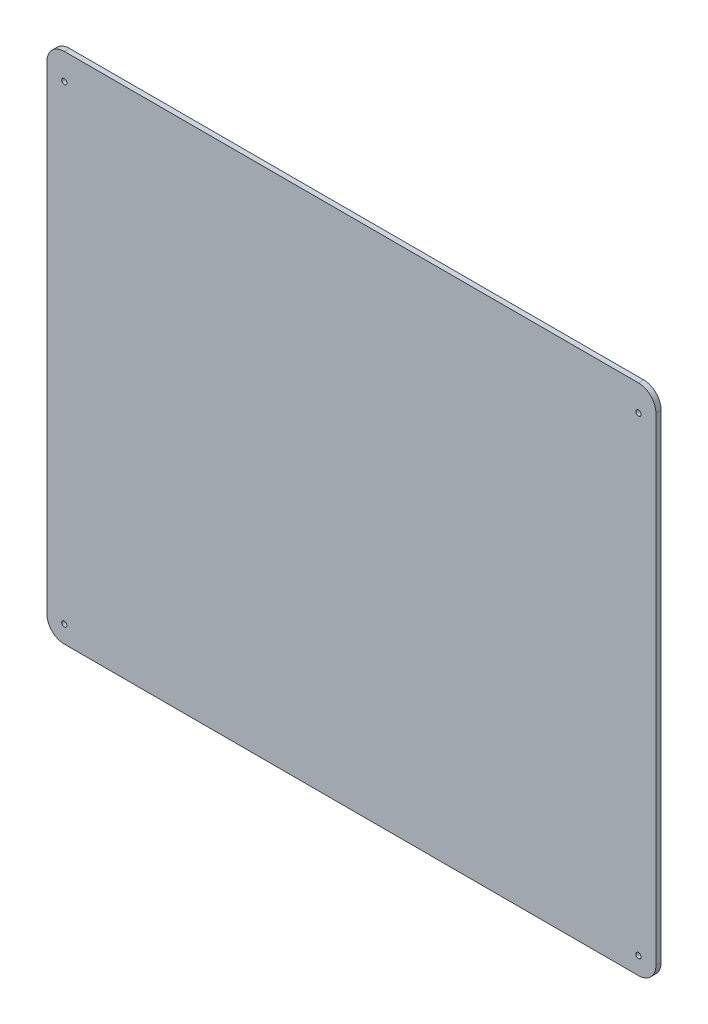
ISO-10303-21;
HEADER;
FILE_DESCRIPTION(('STEP AP214'),'2;1');
FILE_NAME('part.step','',(''),(''),'','','');
FILE_SCHEMA(('AUTOMOTIVE_DESIGN { 1 0 10303 214 1 1 1 1 }'));
ENDSEC;
DATA;
#1=APPLICATION_CONTEXT('core data for automotive mechanical design processes');
#2=APPLICATION_PROTOCOL_DEFINITION('international standard','automotive_design',2000,#1);
#3=PRODUCT_CONTEXT('',#1,'mechanical');
#4=PRODUCT('Part','Part','',(#3));
#5=PRODUCT_RELATED_PRODUCT_CATEGORY('part','',(#4));
#6=PRODUCT_DEFINITION_FORMATION('','',#4);
#7=PRODUCT_DEFINITION_CONTEXT('part definition',#1,'design');
#8=PRODUCT_DEFINITION('design','',#6,#7);
#9=PRODUCT_DEFINITION_SHAPE('','',#8);
#10=(LENGTH_UNIT() NAMED_UNIT(*) SI_UNIT(.MILLI.,.METRE.));
#11=(NAMED_UNIT(*) PLANE_ANGLE_UNIT() SI_UNIT($,.RADIAN.));
#12=(NAMED_UNIT(*) SI_UNIT($,.STERADIAN.) SOLID_ANGLE_UNIT());
#13=UNCERTAINTY_MEASURE_WITH_UNIT(LENGTH_MEASURE(1.E-05),#10,'distance_accuracy_value','');
#14=(GEOMETRIC_REPRESENTATION_CONTEXT(3) GLOBAL_UNCERTAINTY_ASSIGNED_CONTEXT((#13)) GLOBAL_UNIT_ASSIGNED_CONTEXT((#10,
#11,#12)) REPRESENTATION_CONTEXT('',''));
#15=CARTESIAN_POINT('',(0.,0.,0.));
#16=DIRECTION('',(0.,0.,1.));
#17=DIRECTION('',(1.,0.,0.));
#18=AXIS2_PLACEMENT_3D('',#15,#16,#17);
#19=CARTESIAN_POINT('',(10.,285.,3.));
#20=DIRECTION('',(0.,0.,-1.));
#21=DIRECTION('',(-1.,0.,0.));
#22=AXIS2_PLACEMENT_3D('',#19,#20,#21);
#23=CYLINDRICAL_SURFACE('',#22,10.);
#24=CARTESIAN_POINT('',(10.,285.,0.));
#25=DIRECTION('',(0.,0.,1.));
#26=DIRECTION('',(1.,0.,0.));
#27=AXIS2_PLACEMENT_3D('',#24,#25,#26);
#28=CIRCLE('',#27,10.);
#29=CARTESIAN_POINT('',(0.,285.,0.));
#30=VERTEX_POINT('',#29);
#31=CARTESIAN_POINT('',(10.0000000000001,295.,0.));
#32=VERTEX_POINT('',#31);
#33=EDGE_CURVE('E139',#30,#32,#28,.F.);
#34=ORIENTED_EDGE('',*,*,#33,.F.);
#35=DIRECTION('',(0.,0.,-1.));
#36=VECTOR('',#35,1.);
#37=CARTESIAN_POINT('',(0.,285.,3.));
#38=LINE('',#37,#36);
#39=CARTESIAN_POINT('',(0.,285.,3.));
#40=VERTEX_POINT('',#39);
#41=EDGE_CURVE('E11',#40,#30,#38,.T.);
#42=ORIENTED_EDGE('',*,*,#41,.F.);
#43=CARTESIAN_POINT('',(10.,285.,3.));
#44=DIRECTION('',(0.,0.,1.));
#45=DIRECTION('',(1.,0.,0.));
#46=AXIS2_PLACEMENT_3D('',#43,#44,#45);
#47=CIRCLE('',#46,10.);
#48=CARTESIAN_POINT('',(10.0000000000001,295.,3.));
#49=VERTEX_POINT('',#48);
#50=EDGE_CURVE('E189',#40,#49,#47,.F.);
#51=ORIENTED_EDGE('',*,*,#50,.T.);
#52=DIRECTION('',(0.,0.,-1.));
#53=VECTOR('',#52,1.);
#54=CARTESIAN_POINT('',(10.0000000000001,295.,3.));
#55=LINE('',#54,#53);
#56=EDGE_CURVE('E51',#49,#32,#55,.T.);
#57=ORIENTED_EDGE('',*,*,#56,.T.);
#58=EDGE_LOOP('',(#34,#42,#51,#57));
#59=FACE_BOUND('',#58,.T.);
#60=ADVANCED_FACE('F34',(#59),#23,.T.);
#61=CARTESIAN_POINT('',(0.,0.,3.));
#62=DIRECTION('',(-1.,0.,0.));
#63=DIRECTION('',(0.,0.,1.));
#64=AXIS2_PLACEMENT_3D('',#61,#62,#63);
#65=PLANE('',#64);
#66=DIRECTION('',(0.,1.,0.));
#67=VECTOR('',#66,1.);
#68=CARTESIAN_POINT('',(0.,0.,0.));
#69=LINE('',#68,#67);
#70=CARTESIAN_POINT('',(0.,10.0000000000001,0.));
#71=VERTEX_POINT('',#70);
#72=EDGE_CURVE('E141',#71,#30,#69,.T.);
#73=ORIENTED_EDGE('',*,*,#72,.F.);
#74=DIRECTION('',(0.,0.,-1.));
#75=VECTOR('',#74,1.);
#76=CARTESIAN_POINT('',(0.,10.0000000000001,3.));
#77=LINE('',#76,#75);
#78=CARTESIAN_POINT('',(0.,10.0000000000001,3.));
#79=VERTEX_POINT('',#78);
#80=EDGE_CURVE('E43',#79,#71,#77,.T.);
#81=ORIENTED_EDGE('',*,*,#80,.F.);
#82=DIRECTION('',(0.,1.,0.));
#83=VECTOR('',#82,1.);
#84=CARTESIAN_POINT('',(0.,0.,3.));
#85=LINE('',#84,#83);
#86=EDGE_CURVE('E187',#79,#40,#85,.T.);
#87=ORIENTED_EDGE('',*,*,#86,.T.);
#88=ORIENTED_EDGE('',*,*,#41,.T.);
#89=EDGE_LOOP('',(#73,#81,#87,#88));
#90=FACE_BOUND('',#89,.T.);
#91=ADVANCED_FACE('F177',(#90),#65,.T.);
#92=CARTESIAN_POINT('',(10.,10.,3.));
#93=DIRECTION('',(0.,0.,-1.));
#94=DIRECTION('',(-1.,0.,0.));
#95=AXIS2_PLACEMENT_3D('',#92,#93,#94);
#96=CYLINDRICAL_SURFACE('',#95,10.);
#97=CARTESIAN_POINT('',(10.,10.,0.));
#98=DIRECTION('',(0.,0.,1.));
#99=DIRECTION('',(1.,0.,0.));
#100=AXIS2_PLACEMENT_3D('',#97,#98,#99);
#101=CIRCLE('',#100,10.);
#102=CARTESIAN_POINT('',(10.0000000000001,0.,0.));
#103=VERTEX_POINT('',#102);
#104=EDGE_CURVE('E144',#103,#71,#101,.F.);
#105=ORIENTED_EDGE('',*,*,#104,.F.);
#106=DIRECTION('',(0.,0.,-1.));
#107=VECTOR('',#106,1.);
#108=CARTESIAN_POINT('',(10.0000000000001,0.,3.));
#109=LINE('',#108,#107);
#110=CARTESIAN_POINT('',(10.0000000000001,0.,3.));
#111=VERTEX_POINT('',#110);
#112=EDGE_CURVE('E166',#111,#103,#109,.T.);
#113=ORIENTED_EDGE('',*,*,#112,.F.);
#114=CARTESIAN_POINT('',(10.,10.,3.));
#115=DIRECTION('',(0.,0.,1.));
#116=DIRECTION('',(1.,0.,0.));
#117=AXIS2_PLACEMENT_3D('',#114,#115,#116);
#118=CIRCLE('',#117,10.);
#119=EDGE_CURVE('E173',#111,#79,#118,.F.);
#120=ORIENTED_EDGE('',*,*,#119,.T.);
#121=ORIENTED_EDGE('',*,*,#80,.T.);
#122=EDGE_LOOP('',(#105,#113,#120,#121));
#123=FACE_BOUND('',#122,.T.);
#124=ADVANCED_FACE('F171',(#123),#96,.T.);
#125=CARTESIAN_POINT('',(0.,0.,3.));
#126=DIRECTION('',(0.,1.,0.));
#127=DIRECTION('',(0.,0.,1.));
#128=AXIS2_PLACEMENT_3D('',#125,#126,#127);
#129=PLANE('',#128);
#130=DIRECTION('',(1.,0.,0.));
#131=VECTOR('',#130,1.);
#132=CARTESIAN_POINT('',(0.,0.,0.));
#133=LINE('',#132,#131);
#134=CARTESIAN_POINT('',(340.,0.,0.));
#135=VERTEX_POINT('',#134);
#136=EDGE_CURVE('E147',#103,#135,#133,.T.);
#137=ORIENTED_EDGE('',*,*,#136,.T.);
#138=DIRECTION('',(0.,0.,-1.));
#139=VECTOR('',#138,1.);
#140=CARTESIAN_POINT('',(340.,0.,3.));
#141=LINE('',#140,#139);
#142=CARTESIAN_POINT('',(340.,0.,3.));
#143=VERTEX_POINT('',#142);
#144=EDGE_CURVE('E163',#143,#135,#141,.T.);
#145=ORIENTED_EDGE('',*,*,#144,.F.);
#146=DIRECTION('',(1.,0.,0.));
#147=VECTOR('',#146,1.);
#148=CARTESIAN_POINT('',(0.,0.,3.));
#149=LINE('',#148,#147);
#150=EDGE_CURVE('E185',#111,#143,#149,.T.);
#151=ORIENTED_EDGE('',*,*,#150,.F.);
#152=ORIENTED_EDGE('',*,*,#112,.T.);
#153=EDGE_LOOP('',(#137,#145,#151,#152));
#154=FACE_BOUND('',#153,.T.);
#155=ADVANCED_FACE('F183',(#154),#129,.F.);
#156=CARTESIAN_POINT('',(340.,10.,3.));
#157=DIRECTION('',(0.,0.,-1.));
#158=DIRECTION('',(-1.,0.,0.));
#159=AXIS2_PLACEMENT_3D('',#156,#157,#158);
#160=CYLINDRICAL_SURFACE('',#159,10.);
#161=CARTESIAN_POINT('',(340.,10.,0.));
#162=DIRECTION('',(0.,0.,1.));
#163=DIRECTION('',(1.,0.,0.));
#164=AXIS2_PLACEMENT_3D('',#161,#162,#163);
#165=CIRCLE('',#164,10.);
#166=CARTESIAN_POINT('',(350.,10.0000000000001,0.));
#167=VERTEX_POINT('',#166);
#168=EDGE_CURVE('E150',#135,#167,#165,.T.);
#169=ORIENTED_EDGE('',*,*,#168,.T.);
#170=DIRECTION('',(0.,0.,-1.));
#171=VECTOR('',#170,1.);
#172=CARTESIAN_POINT('',(350.,10.0000000000001,3.));
#173=LINE('',#172,#171);
#174=CARTESIAN_POINT('',(350.,10.0000000000001,3.));
#175=VERTEX_POINT('',#174);
#176=EDGE_CURVE('E119',#175,#167,#173,.T.);
#177=ORIENTED_EDGE('',*,*,#176,.F.);
#178=CARTESIAN_POINT('',(340.,10.,3.));
#179=DIRECTION('',(0.,0.,1.));
#180=DIRECTION('',(1.,0.,0.));
#181=AXIS2_PLACEMENT_3D('',#178,#179,#180);
#182=CIRCLE('',#181,10.);
#183=EDGE_CURVE('E108',#143,#175,#182,.T.);
#184=ORIENTED_EDGE('',*,*,#183,.F.);
#185=ORIENTED_EDGE('',*,*,#144,.T.);
#186=EDGE_LOOP('',(#169,#177,#184,#185));
#187=FACE_BOUND('',#186,.T.);
#188=ADVANCED_FACE('F262',(#187),#160,.T.);
#189=CARTESIAN_POINT('',(350.,0.,3.));
#190=DIRECTION('',(-1.,0.,0.));
#191=DIRECTION('',(0.,0.,1.));
#192=AXIS2_PLACEMENT_3D('',#189,#190,#191);
#193=PLANE('',#192);
#194=DIRECTION('',(0.,1.,0.));
#195=VECTOR('',#194,1.);
#196=CARTESIAN_POINT('',(350.,0.,0.));
#197=LINE('',#196,#195);
#198=CARTESIAN_POINT('',(350.,285.,0.));
#199=VERTEX_POINT('',#198);
#200=EDGE_CURVE('E116',#167,#199,#197,.T.);
#201=ORIENTED_EDGE('',*,*,#200,.T.);
#202=DIRECTION('',(0.,0.,-1.));
#203=VECTOR('',#202,1.);
#204=CARTESIAN_POINT('',(350.,285.,3.));
#205=LINE('',#204,#203);
#206=CARTESIAN_POINT('',(350.,285.,3.));
#207=VERTEX_POINT('',#206);
#208=EDGE_CURVE('E114',#207,#199,#205,.T.);
#209=ORIENTED_EDGE('',*,*,#208,.F.);
#210=DIRECTION('',(0.,1.,0.));
#211=VECTOR('',#210,1.);
#212=CARTESIAN_POINT('',(350.,0.,3.));
#213=LINE('',#212,#211);
#214=EDGE_CURVE('E101',#175,#207,#213,.T.);
#215=ORIENTED_EDGE('',*,*,#214,.F.);
#216=ORIENTED_EDGE('',*,*,#176,.T.);
#217=EDGE_LOOP('',(#201,#209,#215,#216));
#218=FACE_BOUND('',#217,.T.);
#219=ADVANCED_FACE('F115',(#218),#193,.F.);
#220=CARTESIAN_POINT('',(340.,285.,3.));
#221=DIRECTION('',(0.,0.,-1.));
#222=DIRECTION('',(-1.,0.,0.));
#223=AXIS2_PLACEMENT_3D('',#220,#221,#222);
#224=CYLINDRICAL_SURFACE('',#223,10.);
#225=CARTESIAN_POINT('',(340.,285.,0.));
#226=DIRECTION('',(0.,0.,1.));
#227=DIRECTION('',(1.,0.,0.));
#228=AXIS2_PLACEMENT_3D('',#225,#226,#227);
#229=CIRCLE('',#228,10.);
#230=CARTESIAN_POINT('',(340.,295.,0.));
#231=VERTEX_POINT('',#230);
#232=EDGE_CURVE('E154',#231,#199,#229,.F.);
#233=ORIENTED_EDGE('',*,*,#232,.F.);
#234=DIRECTION('',(0.,0.,-1.));
#235=VECTOR('',#234,1.);
#236=CARTESIAN_POINT('',(340.,295.,3.));
#237=LINE('',#236,#235);
#238=CARTESIAN_POINT('',(340.,295.,3.));
#239=VERTEX_POINT('',#238);
#240=EDGE_CURVE('E76',#239,#231,#237,.T.);
#241=ORIENTED_EDGE('',*,*,#240,.F.);
#242=CARTESIAN_POINT('',(340.,285.,3.));
#243=DIRECTION('',(0.,0.,1.));
#244=DIRECTION('',(1.,0.,0.));
#245=AXIS2_PLACEMENT_3D('',#242,#243,#244);
#246=CIRCLE('',#245,10.);
#247=EDGE_CURVE('E106',#239,#207,#246,.F.);
#248=ORIENTED_EDGE('',*,*,#247,.T.);
#249=ORIENTED_EDGE('',*,*,#208,.T.);
#250=EDGE_LOOP('',(#233,#241,#248,#249));
#251=FACE_BOUND('',#250,.T.);
#252=ADVANCED_FACE('F121',(#251),#224,.T.);
#253=CARTESIAN_POINT('',(340.,280.,3.));
#254=DIRECTION('',(0.,0.,-1.));
#255=DIRECTION('',(-1.,0.,0.));
#256=AXIS2_PLACEMENT_3D('',#253,#254,#255);
#257=CYLINDRICAL_SURFACE('',#256,1.50000000000002);
#258=CARTESIAN_POINT('',(340.,280.,3.));
#259=DIRECTION('',(0.,0.,1.));
#260=DIRECTION('',(1.,0.,0.));
#261=AXIS2_PLACEMENT_3D('',#258,#259,#260);
#262=CIRCLE('',#261,1.50000000000002);
#263=CARTESIAN_POINT('',(341.5,280.,3.));
#264=VERTEX_POINT('',#263);
#265=EDGE_CURVE('E193',#264,#264,#262,.T.);
#266=ORIENTED_EDGE('',*,*,#265,.T.);
#267=EDGE_LOOP('',(#266));
#268=FACE_BOUND('',#267,.T.);
#269=CARTESIAN_POINT('',(340.,280.,0.));
#270=DIRECTION('',(0.,0.,1.));
#271=DIRECTION('',(1.,0.,0.));
#272=AXIS2_PLACEMENT_3D('',#269,#270,#271);
#273=CIRCLE('',#272,1.50000000000002);
#274=CARTESIAN_POINT('',(341.5,280.,0.));
#275=VERTEX_POINT('',#274);
#276=EDGE_CURVE('E136',#275,#275,#273,.T.);
#277=ORIENTED_EDGE('',*,*,#276,.F.);
#278=EDGE_LOOP('',(#277));
#279=FACE_BOUND('',#278,.T.);
#280=ADVANCED_FACE('F217',(#268,#279),#257,.F.);
#281=CARTESIAN_POINT('',(10.,280.,3.));
#282=DIRECTION('',(0.,0.,-1.));
#283=DIRECTION('',(-1.,0.,0.));
#284=AXIS2_PLACEMENT_3D('',#281,#282,#283);
#285=CYLINDRICAL_SURFACE('',#284,1.5);
#286=CARTESIAN_POINT('',(10.,280.,3.));
#287=DIRECTION('',(0.,0.,1.));
#288=DIRECTION('',(1.,0.,0.));
#289=AXIS2_PLACEMENT_3D('',#286,#287,#288);
#290=CIRCLE('',#289,1.5);
#291=CARTESIAN_POINT('',(11.5,280.,3.));
#292=VERTEX_POINT('',#291);
#293=EDGE_CURVE('E196',#292,#292,#290,.T.);
#294=ORIENTED_EDGE('',*,*,#293,.T.);
#295=EDGE_LOOP('',(#294));
#296=FACE_BOUND('',#295,.T.);
#297=CARTESIAN_POINT('',(10.,280.,0.));
#298=DIRECTION('',(0.,0.,1.));
#299=DIRECTION('',(1.,0.,0.));
#300=AXIS2_PLACEMENT_3D('',#297,#298,#299);
#301=CIRCLE('',#300,1.5);
#302=CARTESIAN_POINT('',(11.5,280.,0.));
#303=VERTEX_POINT('',#302);
#304=EDGE_CURVE('E133',#303,#303,#301,.T.);
#305=ORIENTED_EDGE('',*,*,#304,.F.);
#306=EDGE_LOOP('',(#305));
#307=FACE_BOUND('',#306,.T.);
#308=ADVANCED_FACE('F220',(#296,#307),#285,.F.);
#309=CARTESIAN_POINT('',(10.,10.,3.));
#310=DIRECTION('',(0.,0.,-1.));
#311=DIRECTION('',(-1.,0.,0.));
#312=AXIS2_PLACEMENT_3D('',#309,#310,#311);
#313=CYLINDRICAL_SURFACE('',#312,1.5);
#314=CARTESIAN_POINT('',(10.,10.,3.));
#315=DIRECTION('',(0.,0.,1.));
#316=DIRECTION('',(1.,0.,0.));
#317=AXIS2_PLACEMENT_3D('',#314,#315,#316);
#318=CIRCLE('',#317,1.5);
#319=CARTESIAN_POINT('',(11.5,10.,3.));
#320=VERTEX_POINT('',#319);
#321=EDGE_CURVE('E199',#320,#320,#318,.T.);
#322=ORIENTED_EDGE('',*,*,#321,.T.);
#323=EDGE_LOOP('',(#322));
#324=FACE_BOUND('',#323,.T.);
#325=CARTESIAN_POINT('',(10.,10.,0.));
#326=DIRECTION('',(0.,0.,1.));
#327=DIRECTION('',(1.,0.,0.));
#328=AXIS2_PLACEMENT_3D('',#325,#326,#327);
#329=CIRCLE('',#328,1.5);
#330=CARTESIAN_POINT('',(11.5,10.,0.));
#331=VERTEX_POINT('',#330);
#332=EDGE_CURVE('E130',#331,#331,#329,.T.);
#333=ORIENTED_EDGE('',*,*,#332,.F.);
#334=EDGE_LOOP('',(#333));
#335=FACE_BOUND('',#334,.T.);
#336=ADVANCED_FACE('F240',(#324,#335),#313,.F.);
#337=CARTESIAN_POINT('',(340.,10.,3.));
#338=DIRECTION('',(0.,0.,-1.));
#339=DIRECTION('',(-1.,0.,0.));
#340=AXIS2_PLACEMENT_3D('',#337,#338,#339);
#341=CYLINDRICAL_SURFACE('',#340,1.50000000000002);
#342=CARTESIAN_POINT('',(340.,10.,3.));
#343=DIRECTION('',(0.,0.,1.));
#344=DIRECTION('',(1.,0.,0.));
#345=AXIS2_PLACEMENT_3D('',#342,#343,#344);
#346=CIRCLE('',#345,1.50000000000002);
#347=CARTESIAN_POINT('',(341.5,10.,3.));
#348=VERTEX_POINT('',#347);
#349=EDGE_CURVE('E159',#348,#348,#346,.T.);
#350=ORIENTED_EDGE('',*,*,#349,.T.);
#351=EDGE_LOOP('',(#350));
#352=FACE_BOUND('',#351,.T.);
#353=CARTESIAN_POINT('',(340.,10.,0.));
#354=DIRECTION('',(0.,0.,1.));
#355=DIRECTION('',(1.,0.,0.));
#356=AXIS2_PLACEMENT_3D('',#353,#354,#355);
#357=CIRCLE('',#356,1.50000000000002);
#358=CARTESIAN_POINT('',(341.5,10.,0.));
#359=VERTEX_POINT('',#358);
#360=EDGE_CURVE('E127',#359,#359,#357,.T.);
#361=ORIENTED_EDGE('',*,*,#360,.F.);
#362=EDGE_LOOP('',(#361));
#363=FACE_BOUND('',#362,.T.);
#364=ADVANCED_FACE('F36',(#352,#363),#341,.F.);
#365=CARTESIAN_POINT('',(0.,295.,3.));
#366=DIRECTION('',(0.,1.,0.));
#367=DIRECTION('',(0.,0.,1.));
#368=AXIS2_PLACEMENT_3D('',#365,#366,#367);
#369=PLANE('',#368);
#370=DIRECTION('',(1.,0.,0.));
#371=VECTOR('',#370,1.);
#372=CARTESIAN_POINT('',(0.,295.,0.));
#373=LINE('',#372,#371);
#374=EDGE_CURVE('E156',#32,#231,#373,.T.);
#375=ORIENTED_EDGE('',*,*,#374,.F.);
#376=ORIENTED_EDGE('',*,*,#56,.F.);
#377=DIRECTION('',(1.,0.,0.));
#378=VECTOR('',#377,1.);
#379=CARTESIAN_POINT('',(0.,295.,3.));
#380=LINE('',#379,#378);
#381=EDGE_CURVE('E122',#49,#239,#380,.T.);
#382=ORIENTED_EDGE('',*,*,#381,.T.);
#383=ORIENTED_EDGE('',*,*,#240,.T.);
#384=EDGE_LOOP('',(#375,#376,#382,#383));
#385=FACE_BOUND('',#384,.T.);
#386=ADVANCED_FACE('F209',(#385),#369,.T.);
#387=CARTESIAN_POINT('',(0.,0.,3.));
#388=DIRECTION('',(0.,0.,1.));
#389=DIRECTION('',(1.,0.,0.));
#390=AXIS2_PLACEMENT_3D('',#387,#388,#389);
#391=PLANE('',#390);
#392=ORIENTED_EDGE('',*,*,#349,.F.);
#393=EDGE_LOOP('',(#392));
#394=FACE_BOUND('',#393,.T.);
#395=ORIENTED_EDGE('',*,*,#321,.F.);
#396=EDGE_LOOP('',(#395));
#397=FACE_BOUND('',#396,.T.);
#398=ORIENTED_EDGE('',*,*,#293,.F.);
#399=EDGE_LOOP('',(#398));
#400=FACE_BOUND('',#399,.T.);
#401=ORIENTED_EDGE('',*,*,#265,.F.);
#402=EDGE_LOOP('',(#401));
#403=FACE_BOUND('',#402,.T.);
#404=ORIENTED_EDGE('',*,*,#50,.F.);
#405=ORIENTED_EDGE('',*,*,#86,.F.);
#406=ORIENTED_EDGE('',*,*,#119,.F.);
#407=ORIENTED_EDGE('',*,*,#150,.T.);
#408=ORIENTED_EDGE('',*,*,#183,.T.);
#409=ORIENTED_EDGE('',*,*,#214,.T.);
#410=ORIENTED_EDGE('',*,*,#247,.F.);
#411=ORIENTED_EDGE('',*,*,#381,.F.);
#412=EDGE_LOOP('',(#404,#405,#406,#407,#408,#409,#410,#411));
#413=FACE_BOUND('',#412,.T.);
#414=ADVANCED_FACE('F103',(#394,#397,#400,#403,#413),#391,.T.);
#415=CARTESIAN_POINT('',(0.,0.,0.));
#416=DIRECTION('',(0.,0.,1.));
#417=DIRECTION('',(1.,0.,0.));
#418=AXIS2_PLACEMENT_3D('',#415,#416,#417);
#419=PLANE('',#418);
#420=ORIENTED_EDGE('',*,*,#360,.T.);
#421=EDGE_LOOP('',(#420));
#422=FACE_BOUND('',#421,.T.);
#423=ORIENTED_EDGE('',*,*,#332,.T.);
#424=EDGE_LOOP('',(#423));
#425=FACE_BOUND('',#424,.T.);
#426=ORIENTED_EDGE('',*,*,#304,.T.);
#427=EDGE_LOOP('',(#426));
#428=FACE_BOUND('',#427,.T.);
#429=ORIENTED_EDGE('',*,*,#276,.T.);
#430=EDGE_LOOP('',(#429));
#431=FACE_BOUND('',#430,.T.);
#432=ORIENTED_EDGE('',*,*,#33,.T.);
#433=ORIENTED_EDGE('',*,*,#374,.T.);
#434=ORIENTED_EDGE('',*,*,#232,.T.);
#435=ORIENTED_EDGE('',*,*,#200,.F.);
#436=ORIENTED_EDGE('',*,*,#168,.F.);
#437=ORIENTED_EDGE('',*,*,#136,.F.);
#438=ORIENTED_EDGE('',*,*,#104,.T.);
#439=ORIENTED_EDGE('',*,*,#72,.T.);
#440=EDGE_LOOP('',(#432,#433,#434,#435,#436,#437,#438,#439));
#441=FACE_BOUND('',#440,.T.);
#442=ADVANCED_FACE('F180',(#422,#425,#428,#431,#441),#419,.F.);
#443=CLOSED_SHELL('',(#60,#91,#124,#155,#188,#219,#252,#280,#308,#336,#364,#386,#414,#442));
#444=MANIFOLD_SOLID_BREP('B2',#443);
#445=ADVANCED_BREP_SHAPE_REPRESENTATION('',(#18,#444),#14);
#446=SHAPE_DEFINITION_REPRESENTATION(#9,#445);
ENDSEC;
END-ISO-10303-21;
